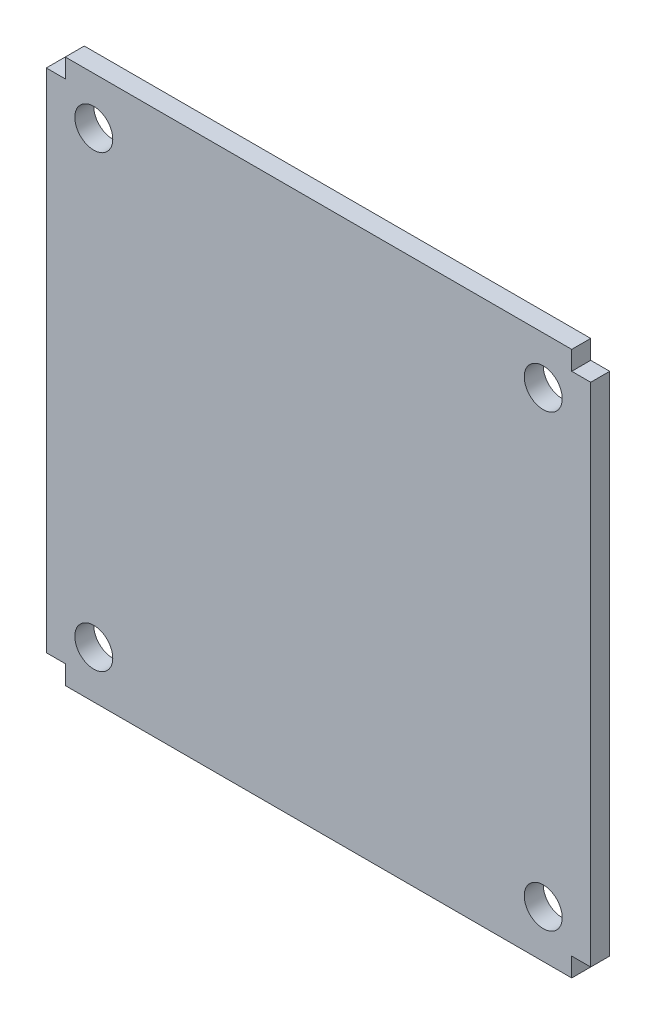
ISO-10303-21;
HEADER;
FILE_DESCRIPTION(('STEP AP214'),'2;1');
FILE_NAME('part.step','',(''),(''),'','','');
FILE_SCHEMA(('AUTOMOTIVE_DESIGN { 1 0 10303 214 1 1 1 1 }'));
ENDSEC;
DATA;
#1=APPLICATION_CONTEXT('core data for automotive mechanical design processes');
#2=APPLICATION_PROTOCOL_DEFINITION('international standard','automotive_design',2000,#1);
#3=PRODUCT_CONTEXT('',#1,'mechanical');
#4=PRODUCT('Part','Part','',(#3));
#5=PRODUCT_RELATED_PRODUCT_CATEGORY('part','',(#4));
#6=PRODUCT_DEFINITION_FORMATION('','',#4);
#7=PRODUCT_DEFINITION_CONTEXT('part definition',#1,'design');
#8=PRODUCT_DEFINITION('design','',#6,#7);
#9=PRODUCT_DEFINITION_SHAPE('','',#8);
#10=(LENGTH_UNIT() NAMED_UNIT(*) SI_UNIT(.MILLI.,.METRE.));
#11=(NAMED_UNIT(*) PLANE_ANGLE_UNIT() SI_UNIT($,.RADIAN.));
#12=(NAMED_UNIT(*) SI_UNIT($,.STERADIAN.) SOLID_ANGLE_UNIT());
#13=UNCERTAINTY_MEASURE_WITH_UNIT(LENGTH_MEASURE(1.E-05),#10,'distance_accuracy_value','');
#14=(GEOMETRIC_REPRESENTATION_CONTEXT(3) GLOBAL_UNCERTAINTY_ASSIGNED_CONTEXT((#13)) GLOBAL_UNIT_ASSIGNED_CONTEXT((#10,
#11,#12)) REPRESENTATION_CONTEXT('',''));
#15=CARTESIAN_POINT('',(0.,0.,0.));
#16=DIRECTION('',(0.,0.,1.));
#17=DIRECTION('',(1.,0.,0.));
#18=AXIS2_PLACEMENT_3D('',#15,#16,#17);
#19=CARTESIAN_POINT('',(0.,0.,3.));
#20=DIRECTION('',(0.,0.,1.));
#21=DIRECTION('',(1.,0.,0.));
#22=AXIS2_PLACEMENT_3D('',#19,#20,#21);
#23=PLANE('',#22);
#24=CARTESIAN_POINT('',(-6.13814562426641,-45.5234191762071,3.));
#25=DIRECTION('',(0.,0.,1.));
#26=DIRECTION('',(1.,0.,0.));
#27=AXIS2_PLACEMENT_3D('',#24,#25,#26);
#28=CIRCLE('',#27,3.);
#29=CARTESIAN_POINT('',(-3.13814562426641,-45.5234191762071,3.));
#30=VERTEX_POINT('',#29);
#31=EDGE_CURVE('E297',#30,#30,#28,.T.);
#32=ORIENTED_EDGE('',*,*,#31,.F.);
#33=EDGE_LOOP('',(#32));
#34=FACE_BOUND('',#33,.T.);
#35=CARTESIAN_POINT('',(-6.13814562426641,25.4765808237929,3.));
#36=DIRECTION('',(0.,0.,1.));
#37=DIRECTION('',(1.,0.,0.));
#38=AXIS2_PLACEMENT_3D('',#35,#36,#37);
#39=CIRCLE('',#38,3.);
#40=CARTESIAN_POINT('',(-3.13814562426641,25.4765808237929,3.));
#41=VERTEX_POINT('',#40);
#42=EDGE_CURVE('E164',#41,#41,#39,.T.);
#43=ORIENTED_EDGE('',*,*,#42,.F.);
#44=EDGE_LOOP('',(#43));
#45=FACE_BOUND('',#44,.T.);
#46=DIRECTION('',(-1.,0.,0.));
#47=VECTOR('',#46,1.);
#48=CARTESIAN_POINT('',(69.3618543757336,32.9765808237929,3.));
#49=LINE('',#48,#47);
#50=CARTESIAN_POINT('',(69.3618543757336,32.9765808237929,3.));
#51=VERTEX_POINT('',#50);
#52=CARTESIAN_POINT('',(-10.6381456242664,32.9765808237929,3.));
#53=VERTEX_POINT('',#52);
#54=EDGE_CURVE('E183',#51,#53,#49,.T.);
#55=ORIENTED_EDGE('',*,*,#54,.T.);
#56=DIRECTION('',(0.,-1.,0.));
#57=VECTOR('',#56,1.);
#58=CARTESIAN_POINT('',(-10.6381456242664,32.9765808237929,3.));
#59=LINE('',#58,#57);
#60=CARTESIAN_POINT('',(-10.6381456242664,29.9765808237929,3.));
#61=VERTEX_POINT('',#60);
#62=EDGE_CURVE('E111',#53,#61,#59,.T.);
#63=ORIENTED_EDGE('',*,*,#62,.T.);
#64=DIRECTION('',(-1.,0.,0.));
#65=VECTOR('',#64,1.);
#66=CARTESIAN_POINT('',(-10.6381456242664,29.9765808237929,3.));
#67=LINE('',#66,#65);
#68=CARTESIAN_POINT('',(-13.6381456242664,29.9765808237929,3.));
#69=VERTEX_POINT('',#68);
#70=EDGE_CURVE('E210',#61,#69,#67,.T.);
#71=ORIENTED_EDGE('',*,*,#70,.T.);
#72=DIRECTION('',(0.,-1.,0.));
#73=VECTOR('',#72,1.);
#74=CARTESIAN_POINT('',(-13.6381456242664,29.9765808237929,3.));
#75=LINE('',#74,#73);
#76=CARTESIAN_POINT('',(-13.6381456242664,-50.0234191762071,3.));
#77=VERTEX_POINT('',#76);
#78=EDGE_CURVE('E229',#69,#77,#75,.T.);
#79=ORIENTED_EDGE('',*,*,#78,.T.);
#80=DIRECTION('',(1.,0.,0.));
#81=VECTOR('',#80,1.);
#82=CARTESIAN_POINT('',(-13.6381456242664,-50.0234191762071,3.));
#83=LINE('',#82,#81);
#84=CARTESIAN_POINT('',(-10.6381456242665,-50.0234191762071,3.));
#85=VERTEX_POINT('',#84);
#86=EDGE_CURVE('E226',#77,#85,#83,.T.);
#87=ORIENTED_EDGE('',*,*,#86,.T.);
#88=DIRECTION('',(0.,-1.,0.));
#89=VECTOR('',#88,1.);
#90=CARTESIAN_POINT('',(-10.6381456242665,-50.0234191762071,3.));
#91=LINE('',#90,#89);
#92=CARTESIAN_POINT('',(-10.6381456242665,-53.0234191762071,3.));
#93=VERTEX_POINT('',#92);
#94=EDGE_CURVE('E228',#85,#93,#91,.T.);
#95=ORIENTED_EDGE('',*,*,#94,.T.);
#96=DIRECTION('',(1.,0.,0.));
#97=VECTOR('',#96,1.);
#98=CARTESIAN_POINT('',(-10.6381456242665,-53.0234191762071,3.));
#99=LINE('',#98,#97);
#100=CARTESIAN_POINT('',(69.3618543757336,-53.0234191762071,3.));
#101=VERTEX_POINT('',#100);
#102=EDGE_CURVE('E231',#93,#101,#99,.T.);
#103=ORIENTED_EDGE('',*,*,#102,.T.);
#104=DIRECTION('',(0.,1.,0.));
#105=VECTOR('',#104,1.);
#106=CARTESIAN_POINT('',(69.3618543757336,-53.0234191762071,3.));
#107=LINE('',#106,#105);
#108=CARTESIAN_POINT('',(69.3618543757336,-50.0234191762071,3.));
#109=VERTEX_POINT('',#108);
#110=EDGE_CURVE('E237',#101,#109,#107,.T.);
#111=ORIENTED_EDGE('',*,*,#110,.T.);
#112=DIRECTION('',(1.,0.,0.));
#113=VECTOR('',#112,1.);
#114=CARTESIAN_POINT('',(69.3618543757336,-50.0234191762071,3.));
#115=LINE('',#114,#113);
#116=CARTESIAN_POINT('',(72.3618543757336,-50.0234191762071,3.));
#117=VERTEX_POINT('',#116);
#118=EDGE_CURVE('E142',#109,#117,#115,.T.);
#119=ORIENTED_EDGE('',*,*,#118,.T.);
#120=DIRECTION('',(0.,1.,0.));
#121=VECTOR('',#120,1.);
#122=CARTESIAN_POINT('',(72.3618543757336,-50.0234191762071,3.));
#123=LINE('',#122,#121);
#124=CARTESIAN_POINT('',(72.3618543757336,29.9765808237929,3.));
#125=VERTEX_POINT('',#124);
#126=EDGE_CURVE('E136',#117,#125,#123,.T.);
#127=ORIENTED_EDGE('',*,*,#126,.T.);
#128=DIRECTION('',(-1.,0.,0.));
#129=VECTOR('',#128,1.);
#130=CARTESIAN_POINT('',(72.3618543757336,29.9765808237929,3.));
#131=LINE('',#130,#129);
#132=CARTESIAN_POINT('',(69.3618543757336,29.9765808237929,3.));
#133=VERTEX_POINT('',#132);
#134=EDGE_CURVE('E140',#125,#133,#131,.T.);
#135=ORIENTED_EDGE('',*,*,#134,.T.);
#136=DIRECTION('',(0.,1.,0.));
#137=VECTOR('',#136,1.);
#138=CARTESIAN_POINT('',(69.3618543757336,29.9765808237929,3.));
#139=LINE('',#138,#137);
#140=EDGE_CURVE('E56',#133,#51,#139,.T.);
#141=ORIENTED_EDGE('',*,*,#140,.T.);
#142=EDGE_LOOP('',(#55,#63,#71,#79,#87,#95,#103,#111,#119,#127,#135,#141));
#143=FACE_BOUND('',#142,.T.);
#144=CARTESIAN_POINT('',(64.8618543757336,25.4765808237929,3.));
#145=DIRECTION('',(0.,0.,1.));
#146=DIRECTION('',(1.,0.,0.));
#147=AXIS2_PLACEMENT_3D('',#144,#145,#146);
#148=CIRCLE('',#147,3.00000000000001);
#149=CARTESIAN_POINT('',(67.8618543757336,25.4765808237929,3.));
#150=VERTEX_POINT('',#149);
#151=EDGE_CURVE('E303',#150,#150,#148,.T.);
#152=ORIENTED_EDGE('',*,*,#151,.F.);
#153=EDGE_LOOP('',(#152));
#154=FACE_BOUND('',#153,.T.);
#155=CARTESIAN_POINT('',(64.8618543757336,-45.5234191762071,3.));
#156=DIRECTION('',(0.,0.,1.));
#157=DIRECTION('',(1.,0.,0.));
#158=AXIS2_PLACEMENT_3D('',#155,#156,#157);
#159=CIRCLE('',#158,3.00000000000001);
#160=CARTESIAN_POINT('',(67.8618543757336,-45.5234191762071,3.));
#161=VERTEX_POINT('',#160);
#162=EDGE_CURVE('E288',#161,#161,#159,.T.);
#163=ORIENTED_EDGE('',*,*,#162,.F.);
#164=EDGE_LOOP('',(#163));
#165=FACE_BOUND('',#164,.T.);
#166=ADVANCED_FACE('F39',(#34,#45,#143,#154,#165),#23,.T.);
#167=CARTESIAN_POINT('',(0.,0.,0.));
#168=DIRECTION('',(0.,0.,1.));
#169=DIRECTION('',(1.,0.,0.));
#170=AXIS2_PLACEMENT_3D('',#167,#168,#169);
#171=PLANE('',#170);
#172=DIRECTION('',(-1.,0.,0.));
#173=VECTOR('',#172,1.);
#174=CARTESIAN_POINT('',(69.3618543757336,32.9765808237929,0.));
#175=LINE('',#174,#173);
#176=CARTESIAN_POINT('',(69.3618543757336,32.9765808237929,0.));
#177=VERTEX_POINT('',#176);
#178=CARTESIAN_POINT('',(-10.6381456242664,32.9765808237929,0.));
#179=VERTEX_POINT('',#178);
#180=EDGE_CURVE('E160',#177,#179,#175,.T.);
#181=ORIENTED_EDGE('',*,*,#180,.F.);
#182=DIRECTION('',(0.,1.,0.));
#183=VECTOR('',#182,1.);
#184=CARTESIAN_POINT('',(69.3618543757336,29.9765808237929,0.));
#185=LINE('',#184,#183);
#186=CARTESIAN_POINT('',(69.3618543757336,29.9765808237929,0.));
#187=VERTEX_POINT('',#186);
#188=EDGE_CURVE('E103',#187,#177,#185,.T.);
#189=ORIENTED_EDGE('',*,*,#188,.F.);
#190=DIRECTION('',(-1.,0.,0.));
#191=VECTOR('',#190,1.);
#192=CARTESIAN_POINT('',(72.3618543757336,29.9765808237929,0.));
#193=LINE('',#192,#191);
#194=CARTESIAN_POINT('',(72.3618543757336,29.9765808237929,0.));
#195=VERTEX_POINT('',#194);
#196=EDGE_CURVE('E97',#195,#187,#193,.T.);
#197=ORIENTED_EDGE('',*,*,#196,.F.);
#198=DIRECTION('',(0.,1.,0.));
#199=VECTOR('',#198,1.);
#200=CARTESIAN_POINT('',(72.3618543757336,-50.0234191762071,0.));
#201=LINE('',#200,#199);
#202=CARTESIAN_POINT('',(72.3618543757336,-50.0234191762071,0.));
#203=VERTEX_POINT('',#202);
#204=EDGE_CURVE('E150',#203,#195,#201,.T.);
#205=ORIENTED_EDGE('',*,*,#204,.F.);
#206=DIRECTION('',(1.,0.,0.));
#207=VECTOR('',#206,1.);
#208=CARTESIAN_POINT('',(69.3618543757336,-50.0234191762071,0.));
#209=LINE('',#208,#207);
#210=CARTESIAN_POINT('',(69.3618543757336,-50.0234191762071,0.));
#211=VERTEX_POINT('',#210);
#212=EDGE_CURVE('E178',#211,#203,#209,.T.);
#213=ORIENTED_EDGE('',*,*,#212,.F.);
#214=DIRECTION('',(0.,1.,0.));
#215=VECTOR('',#214,1.);
#216=CARTESIAN_POINT('',(69.3618543757336,-53.0234191762071,0.));
#217=LINE('',#216,#215);
#218=CARTESIAN_POINT('',(69.3618543757336,-53.0234191762071,0.));
#219=VERTEX_POINT('',#218);
#220=EDGE_CURVE('E176',#219,#211,#217,.T.);
#221=ORIENTED_EDGE('',*,*,#220,.F.);
#222=DIRECTION('',(1.,0.,0.));
#223=VECTOR('',#222,1.);
#224=CARTESIAN_POINT('',(-10.6381456242665,-53.0234191762071,0.));
#225=LINE('',#224,#223);
#226=CARTESIAN_POINT('',(-10.6381456242665,-53.0234191762071,0.));
#227=VERTEX_POINT('',#226);
#228=EDGE_CURVE('E174',#227,#219,#225,.T.);
#229=ORIENTED_EDGE('',*,*,#228,.F.);
#230=DIRECTION('',(0.,-1.,0.));
#231=VECTOR('',#230,1.);
#232=CARTESIAN_POINT('',(-10.6381456242665,-50.0234191762071,0.));
#233=LINE('',#232,#231);
#234=CARTESIAN_POINT('',(-10.6381456242665,-50.0234191762071,0.));
#235=VERTEX_POINT('',#234);
#236=EDGE_CURVE('E172',#235,#227,#233,.T.);
#237=ORIENTED_EDGE('',*,*,#236,.F.);
#238=DIRECTION('',(1.,0.,0.));
#239=VECTOR('',#238,1.);
#240=CARTESIAN_POINT('',(-13.6381456242664,-50.0234191762071,0.));
#241=LINE('',#240,#239);
#242=CARTESIAN_POINT('',(-13.6381456242664,-50.0234191762071,0.));
#243=VERTEX_POINT('',#242);
#244=EDGE_CURVE('E170',#243,#235,#241,.T.);
#245=ORIENTED_EDGE('',*,*,#244,.F.);
#246=DIRECTION('',(0.,-1.,0.));
#247=VECTOR('',#246,1.);
#248=CARTESIAN_POINT('',(-13.6381456242664,29.9765808237929,0.));
#249=LINE('',#248,#247);
#250=CARTESIAN_POINT('',(-13.6381456242664,29.9765808237929,0.));
#251=VERTEX_POINT('',#250);
#252=EDGE_CURVE('E168',#251,#243,#249,.T.);
#253=ORIENTED_EDGE('',*,*,#252,.F.);
#254=DIRECTION('',(-1.,0.,0.));
#255=VECTOR('',#254,1.);
#256=CARTESIAN_POINT('',(-10.6381456242664,29.9765808237929,0.));
#257=LINE('',#256,#255);
#258=CARTESIAN_POINT('',(-10.6381456242664,29.9765808237929,0.));
#259=VERTEX_POINT('',#258);
#260=EDGE_CURVE('E166',#259,#251,#257,.T.);
#261=ORIENTED_EDGE('',*,*,#260,.F.);
#262=DIRECTION('',(0.,-1.,0.));
#263=VECTOR('',#262,1.);
#264=CARTESIAN_POINT('',(-10.6381456242664,32.9765808237929,0.));
#265=LINE('',#264,#263);
#266=EDGE_CURVE('E163',#179,#259,#265,.T.);
#267=ORIENTED_EDGE('',*,*,#266,.F.);
#268=EDGE_LOOP('',(#181,#189,#197,#205,#213,#221,#229,#237,#245,#253,#261,#267));
#269=FACE_BOUND('',#268,.T.);
#270=CARTESIAN_POINT('',(-6.13814562426641,25.4765808237929,0.));
#271=DIRECTION('',(0.,0.,1.));
#272=DIRECTION('',(1.,0.,0.));
#273=AXIS2_PLACEMENT_3D('',#270,#271,#272);
#274=CIRCLE('',#273,3.);
#275=CARTESIAN_POINT('',(-3.13814562426641,25.4765808237929,0.));
#276=VERTEX_POINT('',#275);
#277=EDGE_CURVE('E306',#276,#276,#274,.T.);
#278=ORIENTED_EDGE('',*,*,#277,.T.);
#279=EDGE_LOOP('',(#278));
#280=FACE_BOUND('',#279,.T.);
#281=CARTESIAN_POINT('',(64.8618543757336,25.4765808237929,0.));
#282=DIRECTION('',(0.,0.,1.));
#283=DIRECTION('',(1.,0.,0.));
#284=AXIS2_PLACEMENT_3D('',#281,#282,#283);
#285=CIRCLE('',#284,3.00000000000001);
#286=CARTESIAN_POINT('',(67.8618543757336,25.4765808237929,0.));
#287=VERTEX_POINT('',#286);
#288=EDGE_CURVE('E300',#287,#287,#285,.T.);
#289=ORIENTED_EDGE('',*,*,#288,.T.);
#290=EDGE_LOOP('',(#289));
#291=FACE_BOUND('',#290,.T.);
#292=CARTESIAN_POINT('',(-6.13814562426641,-45.5234191762071,0.));
#293=DIRECTION('',(0.,0.,1.));
#294=DIRECTION('',(1.,0.,0.));
#295=AXIS2_PLACEMENT_3D('',#292,#293,#294);
#296=CIRCLE('',#295,3.);
#297=CARTESIAN_POINT('',(-3.13814562426641,-45.5234191762071,0.));
#298=VERTEX_POINT('',#297);
#299=EDGE_CURVE('E294',#298,#298,#296,.T.);
#300=ORIENTED_EDGE('',*,*,#299,.T.);
#301=EDGE_LOOP('',(#300));
#302=FACE_BOUND('',#301,.T.);
#303=CARTESIAN_POINT('',(64.8618543757336,-45.5234191762071,0.));
#304=DIRECTION('',(0.,0.,1.));
#305=DIRECTION('',(1.,0.,0.));
#306=AXIS2_PLACEMENT_3D('',#303,#304,#305);
#307=CIRCLE('',#306,3.00000000000001);
#308=CARTESIAN_POINT('',(67.8618543757336,-45.5234191762071,0.));
#309=VERTEX_POINT('',#308);
#310=EDGE_CURVE('E291',#309,#309,#307,.T.);
#311=ORIENTED_EDGE('',*,*,#310,.T.);
#312=EDGE_LOOP('',(#311));
#313=FACE_BOUND('',#312,.T.);
#314=ADVANCED_FACE('F214',(#269,#280,#291,#302,#313),#171,.F.);
#315=CARTESIAN_POINT('',(69.3618543757336,32.9765808237929,3.));
#316=DIRECTION('',(0.,-1.,0.));
#317=DIRECTION('',(1.,0.,0.));
#318=AXIS2_PLACEMENT_3D('',#315,#316,#317);
#319=PLANE('',#318);
#320=ORIENTED_EDGE('',*,*,#180,.T.);
#321=DIRECTION('',(0.,0.,-1.));
#322=VECTOR('',#321,1.);
#323=CARTESIAN_POINT('',(-10.6381456242664,32.9765808237929,3.));
#324=LINE('',#323,#322);
#325=EDGE_CURVE('E11',#53,#179,#324,.T.);
#326=ORIENTED_EDGE('',*,*,#325,.F.);
#327=ORIENTED_EDGE('',*,*,#54,.F.);
#328=DIRECTION('',(0.,0.,-1.));
#329=VECTOR('',#328,1.);
#330=CARTESIAN_POINT('',(69.3618543757336,32.9765808237929,3.));
#331=LINE('',#330,#329);
#332=EDGE_CURVE('E156',#51,#177,#331,.T.);
#333=ORIENTED_EDGE('',*,*,#332,.T.);
#334=EDGE_LOOP('',(#320,#326,#327,#333));
#335=FACE_BOUND('',#334,.T.);
#336=ADVANCED_FACE('F41',(#335),#319,.F.);
#337=CARTESIAN_POINT('',(-10.6381456242664,32.9765808237929,3.));
#338=DIRECTION('',(1.,0.,0.));
#339=DIRECTION('',(0.,1.,0.));
#340=AXIS2_PLACEMENT_3D('',#337,#338,#339);
#341=PLANE('',#340);
#342=ORIENTED_EDGE('',*,*,#266,.T.);
#343=DIRECTION('',(0.,0.,-1.));
#344=VECTOR('',#343,1.);
#345=CARTESIAN_POINT('',(-10.6381456242664,29.9765808237929,3.));
#346=LINE('',#345,#344);
#347=EDGE_CURVE('E48',#61,#259,#346,.T.);
#348=ORIENTED_EDGE('',*,*,#347,.F.);
#349=ORIENTED_EDGE('',*,*,#62,.F.);
#350=ORIENTED_EDGE('',*,*,#325,.T.);
#351=EDGE_LOOP('',(#342,#348,#349,#350));
#352=FACE_BOUND('',#351,.T.);
#353=ADVANCED_FACE('F348',(#352),#341,.F.);
#354=CARTESIAN_POINT('',(-10.6381456242664,29.9765808237929,3.));
#355=DIRECTION('',(0.,-1.,0.));
#356=DIRECTION('',(1.,0.,0.));
#357=AXIS2_PLACEMENT_3D('',#354,#355,#356);
#358=PLANE('',#357);
#359=ORIENTED_EDGE('',*,*,#260,.T.);
#360=DIRECTION('',(0.,0.,-1.));
#361=VECTOR('',#360,1.);
#362=CARTESIAN_POINT('',(-13.6381456242664,29.9765808237929,3.));
#363=LINE('',#362,#361);
#364=EDGE_CURVE('E202',#69,#251,#363,.T.);
#365=ORIENTED_EDGE('',*,*,#364,.F.);
#366=ORIENTED_EDGE('',*,*,#70,.F.);
#367=ORIENTED_EDGE('',*,*,#347,.T.);
#368=EDGE_LOOP('',(#359,#365,#366,#367));
#369=FACE_BOUND('',#368,.T.);
#370=ADVANCED_FACE('F208',(#369),#358,.F.);
#371=CARTESIAN_POINT('',(-13.6381456242664,29.9765808237929,3.));
#372=DIRECTION('',(1.,0.,0.));
#373=DIRECTION('',(0.,1.,0.));
#374=AXIS2_PLACEMENT_3D('',#371,#372,#373);
#375=PLANE('',#374);
#376=ORIENTED_EDGE('',*,*,#252,.T.);
#377=DIRECTION('',(0.,0.,-1.));
#378=VECTOR('',#377,1.);
#379=CARTESIAN_POINT('',(-13.6381456242664,-50.0234191762071,3.));
#380=LINE('',#379,#378);
#381=EDGE_CURVE('E199',#77,#243,#380,.T.);
#382=ORIENTED_EDGE('',*,*,#381,.F.);
#383=ORIENTED_EDGE('',*,*,#78,.F.);
#384=ORIENTED_EDGE('',*,*,#364,.T.);
#385=EDGE_LOOP('',(#376,#382,#383,#384));
#386=FACE_BOUND('',#385,.T.);
#387=ADVANCED_FACE('F220',(#386),#375,.F.);
#388=CARTESIAN_POINT('',(-13.6381456242664,-50.0234191762071,3.));
#389=DIRECTION('',(0.,1.,0.));
#390=DIRECTION('',(-1.,0.,0.));
#391=AXIS2_PLACEMENT_3D('',#388,#389,#390);
#392=PLANE('',#391);
#393=ORIENTED_EDGE('',*,*,#244,.T.);
#394=DIRECTION('',(0.,0.,-1.));
#395=VECTOR('',#394,1.);
#396=CARTESIAN_POINT('',(-10.6381456242665,-50.0234191762071,3.));
#397=LINE('',#396,#395);
#398=EDGE_CURVE('E196',#85,#235,#397,.T.);
#399=ORIENTED_EDGE('',*,*,#398,.F.);
#400=ORIENTED_EDGE('',*,*,#86,.F.);
#401=ORIENTED_EDGE('',*,*,#381,.T.);
#402=EDGE_LOOP('',(#393,#399,#400,#401));
#403=FACE_BOUND('',#402,.T.);
#404=ADVANCED_FACE('F224',(#403),#392,.F.);
#405=CARTESIAN_POINT('',(-10.6381456242665,-50.0234191762071,3.));
#406=DIRECTION('',(1.,0.,0.));
#407=DIRECTION('',(0.,0.,-1.));
#408=AXIS2_PLACEMENT_3D('',#405,#406,#407);
#409=PLANE('',#408);
#410=ORIENTED_EDGE('',*,*,#236,.T.);
#411=DIRECTION('',(0.,0.,-1.));
#412=VECTOR('',#411,1.);
#413=CARTESIAN_POINT('',(-10.6381456242665,-53.0234191762071,3.));
#414=LINE('',#413,#412);
#415=EDGE_CURVE('E193',#93,#227,#414,.T.);
#416=ORIENTED_EDGE('',*,*,#415,.F.);
#417=ORIENTED_EDGE('',*,*,#94,.F.);
#418=ORIENTED_EDGE('',*,*,#398,.T.);
#419=EDGE_LOOP('',(#410,#416,#417,#418));
#420=FACE_BOUND('',#419,.T.);
#421=ADVANCED_FACE('F365',(#420),#409,.F.);
#422=CARTESIAN_POINT('',(-10.6381456242665,-53.0234191762071,3.));
#423=DIRECTION('',(0.,1.,0.));
#424=DIRECTION('',(0.,0.,1.));
#425=AXIS2_PLACEMENT_3D('',#422,#423,#424);
#426=PLANE('',#425);
#427=ORIENTED_EDGE('',*,*,#228,.T.);
#428=DIRECTION('',(0.,0.,-1.));
#429=VECTOR('',#428,1.);
#430=CARTESIAN_POINT('',(69.3618543757336,-53.0234191762071,3.));
#431=LINE('',#430,#429);
#432=EDGE_CURVE('E190',#101,#219,#431,.T.);
#433=ORIENTED_EDGE('',*,*,#432,.F.);
#434=ORIENTED_EDGE('',*,*,#102,.F.);
#435=ORIENTED_EDGE('',*,*,#415,.T.);
#436=EDGE_LOOP('',(#427,#433,#434,#435));
#437=FACE_BOUND('',#436,.T.);
#438=ADVANCED_FACE('F369',(#437),#426,.F.);
#439=CARTESIAN_POINT('',(69.3618543757336,-53.0234191762071,3.));
#440=DIRECTION('',(-1.,0.,0.));
#441=DIRECTION('',(0.,0.,1.));
#442=AXIS2_PLACEMENT_3D('',#439,#440,#441);
#443=PLANE('',#442);
#444=ORIENTED_EDGE('',*,*,#220,.T.);
#445=DIRECTION('',(0.,0.,-1.));
#446=VECTOR('',#445,1.);
#447=CARTESIAN_POINT('',(69.3618543757336,-50.0234191762071,3.));
#448=LINE('',#447,#446);
#449=EDGE_CURVE('E187',#109,#211,#448,.T.);
#450=ORIENTED_EDGE('',*,*,#449,.F.);
#451=ORIENTED_EDGE('',*,*,#110,.F.);
#452=ORIENTED_EDGE('',*,*,#432,.T.);
#453=EDGE_LOOP('',(#444,#450,#451,#452));
#454=FACE_BOUND('',#453,.T.);
#455=ADVANCED_FACE('F243',(#454),#443,.F.);
#456=CARTESIAN_POINT('',(69.3618543757336,-50.0234191762071,3.));
#457=DIRECTION('',(0.,1.,0.));
#458=DIRECTION('',(-1.,0.,0.));
#459=AXIS2_PLACEMENT_3D('',#456,#457,#458);
#460=PLANE('',#459);
#461=ORIENTED_EDGE('',*,*,#212,.T.);
#462=DIRECTION('',(0.,0.,-1.));
#463=VECTOR('',#462,1.);
#464=CARTESIAN_POINT('',(72.3618543757336,-50.0234191762071,3.));
#465=LINE('',#464,#463);
#466=EDGE_CURVE('E151',#117,#203,#465,.T.);
#467=ORIENTED_EDGE('',*,*,#466,.F.);
#468=ORIENTED_EDGE('',*,*,#118,.F.);
#469=ORIENTED_EDGE('',*,*,#449,.T.);
#470=EDGE_LOOP('',(#461,#467,#468,#469));
#471=FACE_BOUND('',#470,.T.);
#472=ADVANCED_FACE('F247',(#471),#460,.F.);
#473=CARTESIAN_POINT('',(72.3618543757336,-50.0234191762071,3.));
#474=DIRECTION('',(-1.,0.,0.));
#475=DIRECTION('',(0.,-1.,0.));
#476=AXIS2_PLACEMENT_3D('',#473,#474,#475);
#477=PLANE('',#476);
#478=ORIENTED_EDGE('',*,*,#204,.T.);
#479=DIRECTION('',(0.,0.,-1.));
#480=VECTOR('',#479,1.);
#481=CARTESIAN_POINT('',(72.3618543757336,29.9765808237929,3.));
#482=LINE('',#481,#480);
#483=EDGE_CURVE('E147',#125,#195,#482,.T.);
#484=ORIENTED_EDGE('',*,*,#483,.F.);
#485=ORIENTED_EDGE('',*,*,#126,.F.);
#486=ORIENTED_EDGE('',*,*,#466,.T.);
#487=EDGE_LOOP('',(#478,#484,#485,#486));
#488=FACE_BOUND('',#487,.T.);
#489=ADVANCED_FACE('F148',(#488),#477,.F.);
#490=CARTESIAN_POINT('',(72.3618543757336,29.9765808237929,3.));
#491=DIRECTION('',(0.,-1.,0.));
#492=DIRECTION('',(1.,0.,0.));
#493=AXIS2_PLACEMENT_3D('',#490,#491,#492);
#494=PLANE('',#493);
#495=ORIENTED_EDGE('',*,*,#196,.T.);
#496=DIRECTION('',(0.,0.,-1.));
#497=VECTOR('',#496,1.);
#498=CARTESIAN_POINT('',(69.3618543757336,29.9765808237929,3.));
#499=LINE('',#498,#497);
#500=EDGE_CURVE('E152',#133,#187,#499,.T.);
#501=ORIENTED_EDGE('',*,*,#500,.F.);
#502=ORIENTED_EDGE('',*,*,#134,.F.);
#503=ORIENTED_EDGE('',*,*,#483,.T.);
#504=EDGE_LOOP('',(#495,#501,#502,#503));
#505=FACE_BOUND('',#504,.T.);
#506=ADVANCED_FACE('F154',(#505),#494,.F.);
#507=CARTESIAN_POINT('',(69.3618543757336,29.9765808237929,3.));
#508=DIRECTION('',(-1.,0.,0.));
#509=DIRECTION('',(0.,0.,1.));
#510=AXIS2_PLACEMENT_3D('',#507,#508,#509);
#511=PLANE('',#510);
#512=ORIENTED_EDGE('',*,*,#188,.T.);
#513=ORIENTED_EDGE('',*,*,#332,.F.);
#514=ORIENTED_EDGE('',*,*,#140,.F.);
#515=ORIENTED_EDGE('',*,*,#500,.T.);
#516=EDGE_LOOP('',(#512,#513,#514,#515));
#517=FACE_BOUND('',#516,.T.);
#518=ADVANCED_FACE('F251',(#517),#511,.F.);
#519=CARTESIAN_POINT('',(-6.13814562426641,25.4765808237929,3.));
#520=DIRECTION('',(0.,0.,-1.));
#521=DIRECTION('',(-1.,0.,0.));
#522=AXIS2_PLACEMENT_3D('',#519,#520,#521);
#523=CYLINDRICAL_SURFACE('',#522,3.);
#524=ORIENTED_EDGE('',*,*,#42,.T.);
#525=EDGE_LOOP('',(#524));
#526=FACE_BOUND('',#525,.T.);
#527=ORIENTED_EDGE('',*,*,#277,.F.);
#528=EDGE_LOOP('',(#527));
#529=FACE_BOUND('',#528,.T.);
#530=ADVANCED_FACE('F253',(#526,#529),#523,.F.);
#531=CARTESIAN_POINT('',(64.8618543757336,25.4765808237929,3.));
#532=DIRECTION('',(0.,0.,-1.));
#533=DIRECTION('',(-1.,0.,0.));
#534=AXIS2_PLACEMENT_3D('',#531,#532,#533);
#535=CYLINDRICAL_SURFACE('',#534,3.00000000000001);
#536=ORIENTED_EDGE('',*,*,#151,.T.);
#537=EDGE_LOOP('',(#536));
#538=FACE_BOUND('',#537,.T.);
#539=ORIENTED_EDGE('',*,*,#288,.F.);
#540=EDGE_LOOP('',(#539));
#541=FACE_BOUND('',#540,.T.);
#542=ADVANCED_FACE('F259',(#538,#541),#535,.F.);
#543=CARTESIAN_POINT('',(-6.13814562426641,-45.5234191762071,3.));
#544=DIRECTION('',(0.,0.,-1.));
#545=DIRECTION('',(-1.,0.,0.));
#546=AXIS2_PLACEMENT_3D('',#543,#544,#545);
#547=CYLINDRICAL_SURFACE('',#546,3.);
#548=ORIENTED_EDGE('',*,*,#31,.T.);
#549=EDGE_LOOP('',(#548));
#550=FACE_BOUND('',#549,.T.);
#551=ORIENTED_EDGE('',*,*,#299,.F.);
#552=EDGE_LOOP('',(#551));
#553=FACE_BOUND('',#552,.T.);
#554=ADVANCED_FACE('F275',(#550,#553),#547,.F.);
#555=CARTESIAN_POINT('',(64.8618543757336,-45.5234191762071,3.));
#556=DIRECTION('',(0.,0.,-1.));
#557=DIRECTION('',(-1.,0.,0.));
#558=AXIS2_PLACEMENT_3D('',#555,#556,#557);
#559=CYLINDRICAL_SURFACE('',#558,3.00000000000001);
#560=ORIENTED_EDGE('',*,*,#162,.T.);
#561=EDGE_LOOP('',(#560));
#562=FACE_BOUND('',#561,.T.);
#563=ORIENTED_EDGE('',*,*,#310,.F.);
#564=EDGE_LOOP('',(#563));
#565=FACE_BOUND('',#564,.T.);
#566=ADVANCED_FACE('F279',(#562,#565),#559,.F.);
#567=CLOSED_SHELL('',(#166,#314,#336,#353,#370,#387,#404,#421,#438,#455,#472,#489,#506,#518,
#530,#542,#554,#566));
#568=MANIFOLD_SOLID_BREP('B2',#567);
#569=ADVANCED_BREP_SHAPE_REPRESENTATION('',(#18,#568),#14);
#570=SHAPE_DEFINITION_REPRESENTATION(#9,#569);
ENDSEC;
END-ISO-10303-21;
